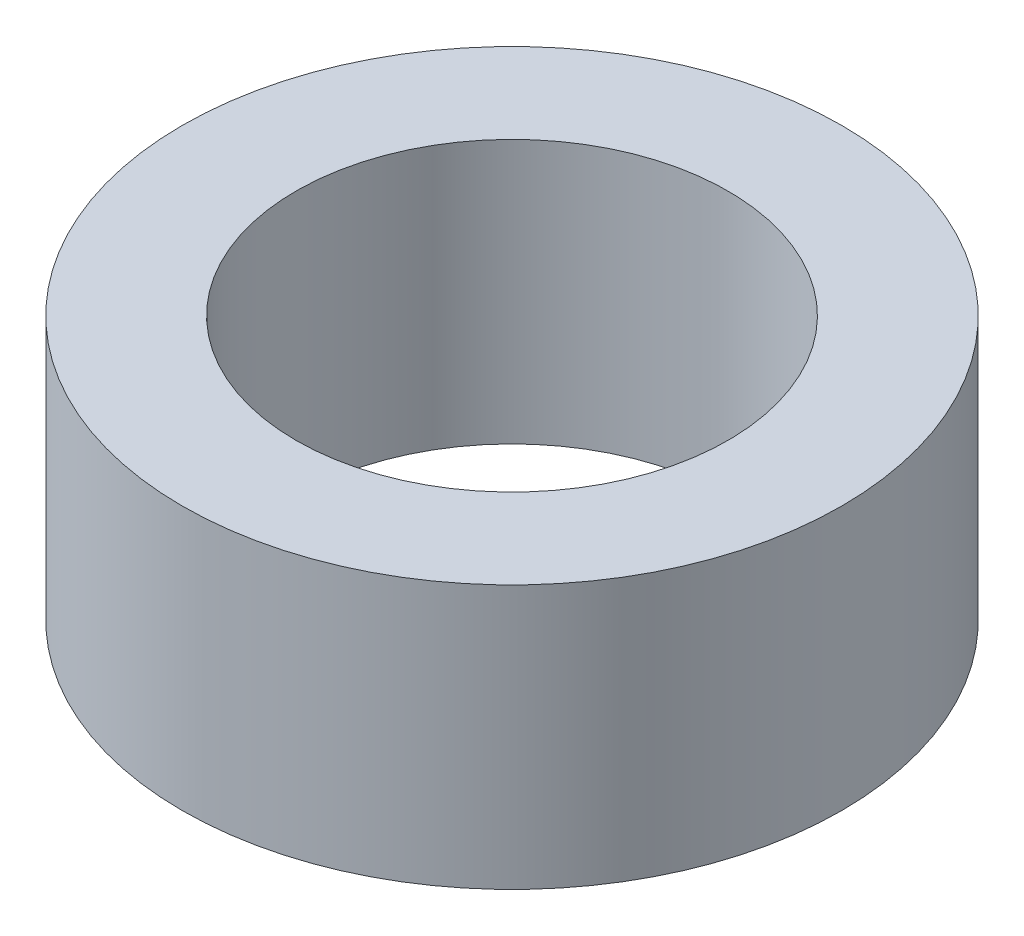
ISO-10303-21;
HEADER;
FILE_DESCRIPTION(('STEP AP214'),'2;1');
FILE_NAME('part.step','',(''),(''),'','','');
FILE_SCHEMA(('AUTOMOTIVE_DESIGN { 1 0 10303 214 1 1 1 1 }'));
ENDSEC;
DATA;
#1=APPLICATION_CONTEXT('core data for automotive mechanical design processes');
#2=APPLICATION_PROTOCOL_DEFINITION('international standard','automotive_design',2000,#1);
#3=PRODUCT_CONTEXT('',#1,'mechanical');
#4=PRODUCT('Part','Part','',(#3));
#5=PRODUCT_RELATED_PRODUCT_CATEGORY('part','',(#4));
#6=PRODUCT_DEFINITION_FORMATION('','',#4);
#7=PRODUCT_DEFINITION_CONTEXT('part definition',#1,'design');
#8=PRODUCT_DEFINITION('design','',#6,#7);
#9=PRODUCT_DEFINITION_SHAPE('','',#8);
#10=(LENGTH_UNIT() NAMED_UNIT(*) SI_UNIT(.MILLI.,.METRE.));
#11=(NAMED_UNIT(*) PLANE_ANGLE_UNIT() SI_UNIT($,.RADIAN.));
#12=(NAMED_UNIT(*) SI_UNIT($,.STERADIAN.) SOLID_ANGLE_UNIT());
#13=UNCERTAINTY_MEASURE_WITH_UNIT(LENGTH_MEASURE(1.E-05),#10,'distance_accuracy_value','');
#14=(GEOMETRIC_REPRESENTATION_CONTEXT(3) GLOBAL_UNCERTAINTY_ASSIGNED_CONTEXT((#13)) GLOBAL_UNIT_ASSIGNED_CONTEXT((#10,
#11,#12)) REPRESENTATION_CONTEXT('',''));
#15=CARTESIAN_POINT('',(0.,0.,0.));
#16=DIRECTION('',(0.,0.,1.));
#17=DIRECTION('',(1.,0.,0.));
#18=AXIS2_PLACEMENT_3D('',#15,#16,#17);
#19=CARTESIAN_POINT('',(0.,3.175,0.));
#20=DIRECTION('',(0.,1.,0.));
#21=DIRECTION('',(0.,0.,1.));
#22=AXIS2_PLACEMENT_3D('',#19,#20,#21);
#23=PLANE('',#22);
#24=CARTESIAN_POINT('',(0.,3.175,0.));
#25=DIRECTION('',(0.,1.,0.));
#26=DIRECTION('',(0.,0.,1.));
#27=AXIS2_PLACEMENT_3D('',#24,#25,#26);
#28=CIRCLE('',#27,3.96875);
#29=CARTESIAN_POINT('',(0.,3.175,3.96875));
#30=VERTEX_POINT('',#29);
#31=EDGE_CURVE('E10',#30,#30,#28,.T.);
#32=ORIENTED_EDGE('',*,*,#31,.T.);
#33=EDGE_LOOP('',(#32));
#34=FACE_BOUND('',#33,.T.);
#35=CARTESIAN_POINT('',(0.,3.175,0.));
#36=DIRECTION('',(0.,1.,0.));
#37=DIRECTION('',(0.,0.,1.));
#38=AXIS2_PLACEMENT_3D('',#35,#36,#37);
#39=CIRCLE('',#38,2.6);
#40=CARTESIAN_POINT('',(0.,3.175,2.6));
#41=VERTEX_POINT('',#40);
#42=EDGE_CURVE('E50',#41,#41,#39,.T.);
#43=ORIENTED_EDGE('',*,*,#42,.F.);
#44=EDGE_LOOP('',(#43));
#45=FACE_BOUND('',#44,.T.);
#46=ADVANCED_FACE('F39',(#34,#45),#23,.T.);
#47=CARTESIAN_POINT('',(0.,0.,0.));
#48=DIRECTION('',(0.,1.,0.));
#49=DIRECTION('',(0.,0.,1.));
#50=AXIS2_PLACEMENT_3D('',#47,#48,#49);
#51=PLANE('',#50);
#52=CARTESIAN_POINT('',(0.,0.,0.));
#53=DIRECTION('',(0.,1.,0.));
#54=DIRECTION('',(0.,0.,1.));
#55=AXIS2_PLACEMENT_3D('',#52,#53,#54);
#56=CIRCLE('',#55,3.96875);
#57=CARTESIAN_POINT('',(0.,0.,3.96875));
#58=VERTEX_POINT('',#57);
#59=EDGE_CURVE('E43',#58,#58,#56,.T.);
#60=ORIENTED_EDGE('',*,*,#59,.F.);
#61=EDGE_LOOP('',(#60));
#62=FACE_BOUND('',#61,.T.);
#63=CARTESIAN_POINT('',(0.,0.,0.));
#64=DIRECTION('',(0.,1.,0.));
#65=DIRECTION('',(0.,0.,1.));
#66=AXIS2_PLACEMENT_3D('',#63,#64,#65);
#67=CIRCLE('',#66,2.6);
#68=CARTESIAN_POINT('',(0.,0.,2.6));
#69=VERTEX_POINT('',#68);
#70=EDGE_CURVE('E52',#69,#69,#67,.T.);
#71=ORIENTED_EDGE('',*,*,#70,.T.);
#72=EDGE_LOOP('',(#71));
#73=FACE_BOUND('',#72,.T.);
#74=ADVANCED_FACE('F62',(#62,#73),#51,.F.);
#75=CARTESIAN_POINT('',(0.,3.175,0.));
#76=DIRECTION('',(0.,-1.,0.));
#77=DIRECTION('',(0.,0.,-1.));
#78=AXIS2_PLACEMENT_3D('',#75,#76,#77);
#79=CYLINDRICAL_SURFACE('',#78,3.96875);
#80=ORIENTED_EDGE('',*,*,#31,.F.);
#81=EDGE_LOOP('',(#80));
#82=FACE_BOUND('',#81,.T.);
#83=ORIENTED_EDGE('',*,*,#59,.T.);
#84=EDGE_LOOP('',(#83));
#85=FACE_BOUND('',#84,.T.);
#86=ADVANCED_FACE('F41',(#82,#85),#79,.T.);
#87=CARTESIAN_POINT('',(0.,3.175,0.));
#88=DIRECTION('',(0.,-1.,0.));
#89=DIRECTION('',(0.,0.,-1.));
#90=AXIS2_PLACEMENT_3D('',#87,#88,#89);
#91=CYLINDRICAL_SURFACE('',#90,2.6);
#92=ORIENTED_EDGE('',*,*,#42,.T.);
#93=EDGE_LOOP('',(#92));
#94=FACE_BOUND('',#93,.T.);
#95=ORIENTED_EDGE('',*,*,#70,.F.);
#96=EDGE_LOOP('',(#95));
#97=FACE_BOUND('',#96,.T.);
#98=ADVANCED_FACE('F58',(#94,#97),#91,.F.);
#99=CLOSED_SHELL('',(#46,#74,#86,#98));
#100=MANIFOLD_SOLID_BREP('B2',#99);
#101=ADVANCED_BREP_SHAPE_REPRESENTATION('',(#18,#100),#14);
#102=SHAPE_DEFINITION_REPRESENTATION(#9,#101);
ENDSEC;
END-ISO-10303-21;
